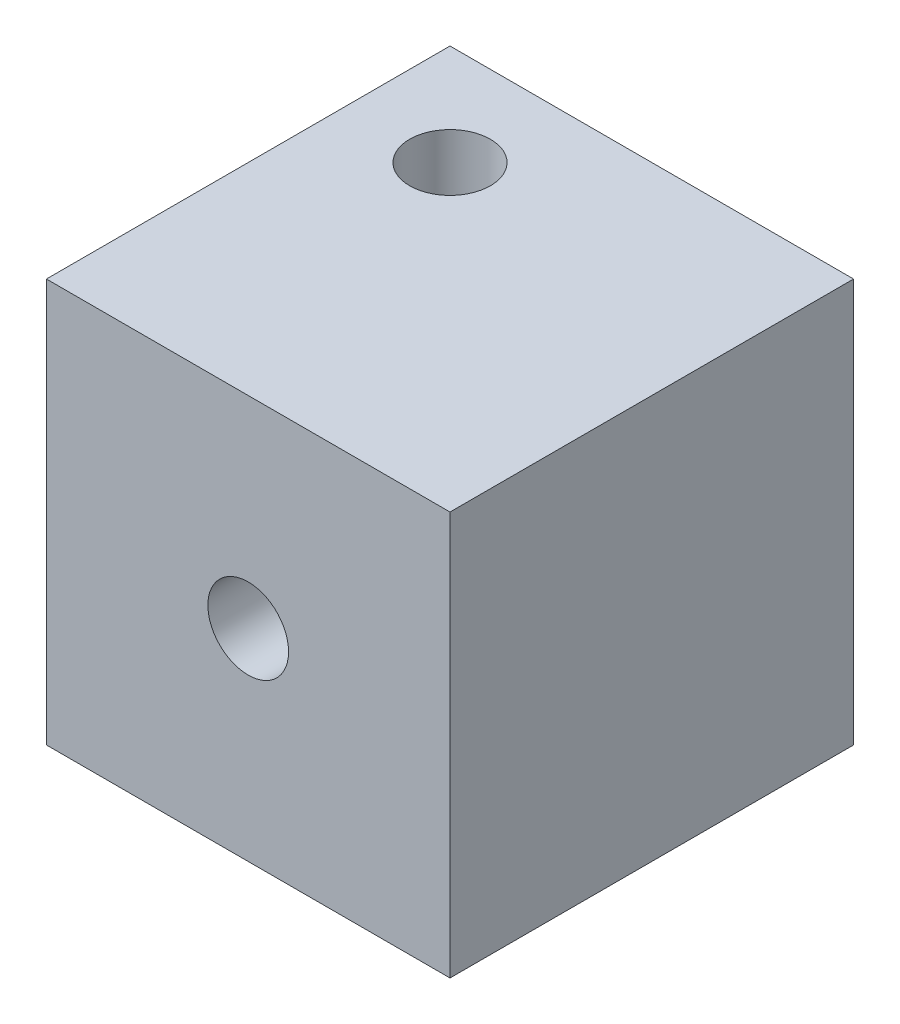
ISO-10303-21;
HEADER;
FILE_DESCRIPTION(('STEP AP214'),'2;1');
FILE_NAME('part.step','',(''),(''),'','','');
FILE_SCHEMA(('AUTOMOTIVE_DESIGN { 1 0 10303 214 1 1 1 1 }'));
ENDSEC;
DATA;
#1=APPLICATION_CONTEXT('core data for automotive mechanical design processes');
#2=APPLICATION_PROTOCOL_DEFINITION('international standard','automotive_design',2000,#1);
#3=PRODUCT_CONTEXT('',#1,'mechanical');
#4=PRODUCT('Part','Part','',(#3));
#5=PRODUCT_RELATED_PRODUCT_CATEGORY('part','',(#4));
#6=PRODUCT_DEFINITION_FORMATION('','',#4);
#7=PRODUCT_DEFINITION_CONTEXT('part definition',#1,'design');
#8=PRODUCT_DEFINITION('design','',#6,#7);
#9=PRODUCT_DEFINITION_SHAPE('','',#8);
#10=(LENGTH_UNIT() NAMED_UNIT(*) SI_UNIT(.MILLI.,.METRE.));
#11=(NAMED_UNIT(*) PLANE_ANGLE_UNIT() SI_UNIT($,.RADIAN.));
#12=(NAMED_UNIT(*) SI_UNIT($,.STERADIAN.) SOLID_ANGLE_UNIT());
#13=UNCERTAINTY_MEASURE_WITH_UNIT(LENGTH_MEASURE(1.E-05),#10,'distance_accuracy_value','');
#14=(GEOMETRIC_REPRESENTATION_CONTEXT(3) GLOBAL_UNCERTAINTY_ASSIGNED_CONTEXT((#13)) GLOBAL_UNIT_ASSIGNED_CONTEXT((#10,
#11,#12)) REPRESENTATION_CONTEXT('',''));
#15=CARTESIAN_POINT('',(0.,0.,0.));
#16=DIRECTION('',(0.,0.,1.));
#17=DIRECTION('',(1.,0.,0.));
#18=AXIS2_PLACEMENT_3D('',#15,#16,#17);
#19=CARTESIAN_POINT('',(-100.,100.,100.));
#20=DIRECTION('',(1.,0.,0.));
#21=DIRECTION('',(0.,0.,-1.));
#22=AXIS2_PLACEMENT_3D('',#19,#20,#21);
#23=PLANE('',#22);
#24=DIRECTION('',(0.,-1.,0.));
#25=VECTOR('',#24,1.);
#26=CARTESIAN_POINT('',(-100.,100.,0.));
#27=LINE('',#26,#25);
#28=CARTESIAN_POINT('',(-100.,100.,0.));
#29=VERTEX_POINT('',#28);
#30=CARTESIAN_POINT('',(-100.,0.,0.));
#31=VERTEX_POINT('',#30);
#32=EDGE_CURVE('E96',#29,#31,#27,.T.);
#33=ORIENTED_EDGE('',*,*,#32,.T.);
#34=DIRECTION('',(0.,0.,-1.));
#35=VECTOR('',#34,1.);
#36=CARTESIAN_POINT('',(-100.,0.,100.));
#37=LINE('',#36,#35);
#38=CARTESIAN_POINT('',(-100.,0.,100.));
#39=VERTEX_POINT('',#38);
#40=EDGE_CURVE('E11',#39,#31,#37,.T.);
#41=ORIENTED_EDGE('',*,*,#40,.F.);
#42=DIRECTION('',(0.,-1.,0.));
#43=VECTOR('',#42,1.);
#44=CARTESIAN_POINT('',(-100.,100.,100.));
#45=LINE('',#44,#43);
#46=CARTESIAN_POINT('',(-100.,100.,100.));
#47=VERTEX_POINT('',#46);
#48=EDGE_CURVE('E84',#47,#39,#45,.T.);
#49=ORIENTED_EDGE('',*,*,#48,.F.);
#50=DIRECTION('',(0.,0.,-1.));
#51=VECTOR('',#50,1.);
#52=CARTESIAN_POINT('',(-100.,100.,100.));
#53=LINE('',#52,#51);
#54=EDGE_CURVE('E92',#47,#29,#53,.T.);
#55=ORIENTED_EDGE('',*,*,#54,.T.);
#56=EDGE_LOOP('',(#33,#41,#49,#55));
#57=FACE_BOUND('',#56,.T.);
#58=ADVANCED_FACE('F33',(#57),#23,.F.);
#59=CARTESIAN_POINT('',(-100.,0.,100.));
#60=DIRECTION('',(0.,1.,0.));
#61=DIRECTION('',(0.,0.,1.));
#62=AXIS2_PLACEMENT_3D('',#59,#60,#61);
#63=PLANE('',#62);
#64=CARTESIAN_POINT('',(-75.,0.,25.));
#65=DIRECTION('',(0.,1.,0.));
#66=DIRECTION('',(0.,0.,1.));
#67=AXIS2_PLACEMENT_3D('',#64,#65,#66);
#68=CIRCLE('',#67,10.);
#69=CARTESIAN_POINT('',(-75.,0.,35.));
#70=VERTEX_POINT('',#69);
#71=EDGE_CURVE('E113',#70,#70,#68,.T.);
#72=ORIENTED_EDGE('',*,*,#71,.T.);
#73=EDGE_LOOP('',(#72));
#74=FACE_BOUND('',#73,.T.);
#75=DIRECTION('',(1.,0.,0.));
#76=VECTOR('',#75,1.);
#77=CARTESIAN_POINT('',(-100.,0.,0.));
#78=LINE('',#77,#76);
#79=CARTESIAN_POINT('',(0.,0.,0.));
#80=VERTEX_POINT('',#79);
#81=EDGE_CURVE('E88',#31,#80,#78,.T.);
#82=ORIENTED_EDGE('',*,*,#81,.T.);
#83=DIRECTION('',(0.,0.,-1.));
#84=VECTOR('',#83,1.);
#85=CARTESIAN_POINT('',(0.,0.,100.));
#86=LINE('',#85,#84);
#87=CARTESIAN_POINT('',(0.,0.,100.));
#88=VERTEX_POINT('',#87);
#89=EDGE_CURVE('E41',#88,#80,#86,.T.);
#90=ORIENTED_EDGE('',*,*,#89,.F.);
#91=DIRECTION('',(1.,0.,0.));
#92=VECTOR('',#91,1.);
#93=CARTESIAN_POINT('',(-100.,0.,100.));
#94=LINE('',#93,#92);
#95=EDGE_CURVE('E79',#39,#88,#94,.T.);
#96=ORIENTED_EDGE('',*,*,#95,.F.);
#97=ORIENTED_EDGE('',*,*,#40,.T.);
#98=EDGE_LOOP('',(#82,#90,#96,#97));
#99=FACE_BOUND('',#98,.T.);
#100=ADVANCED_FACE('F87',(#74,#99),#63,.F.);
#101=CARTESIAN_POINT('',(0.,100.,100.));
#102=DIRECTION('',(-1.,0.,0.));
#103=DIRECTION('',(0.,-1.,0.));
#104=AXIS2_PLACEMENT_3D('',#101,#102,#103);
#105=PLANE('',#104);
#106=DIRECTION('',(0.,1.,0.));
#107=VECTOR('',#106,1.);
#108=CARTESIAN_POINT('',(0.,100.,0.));
#109=LINE('',#108,#107);
#110=CARTESIAN_POINT('',(0.,100.,0.));
#111=VERTEX_POINT('',#110);
#112=EDGE_CURVE('E66',#80,#111,#109,.T.);
#113=ORIENTED_EDGE('',*,*,#112,.T.);
#114=DIRECTION('',(0.,0.,-1.));
#115=VECTOR('',#114,1.);
#116=CARTESIAN_POINT('',(0.,100.,100.));
#117=LINE('',#116,#115);
#118=CARTESIAN_POINT('',(0.,100.,100.));
#119=VERTEX_POINT('',#118);
#120=EDGE_CURVE('E89',#119,#111,#117,.T.);
#121=ORIENTED_EDGE('',*,*,#120,.F.);
#122=DIRECTION('',(0.,1.,0.));
#123=VECTOR('',#122,1.);
#124=CARTESIAN_POINT('',(0.,100.,100.));
#125=LINE('',#124,#123);
#126=EDGE_CURVE('E82',#88,#119,#125,.T.);
#127=ORIENTED_EDGE('',*,*,#126,.F.);
#128=ORIENTED_EDGE('',*,*,#89,.T.);
#129=EDGE_LOOP('',(#113,#121,#127,#128));
#130=FACE_BOUND('',#129,.T.);
#131=ADVANCED_FACE('F90',(#130),#105,.F.);
#132=CARTESIAN_POINT('',(-100.,100.,100.));
#133=DIRECTION('',(0.,-1.,0.));
#134=DIRECTION('',(0.,0.,-1.));
#135=AXIS2_PLACEMENT_3D('',#132,#133,#134);
#136=PLANE('',#135);
#137=CARTESIAN_POINT('',(-75.,100.,25.));
#138=DIRECTION('',(0.,1.,0.));
#139=DIRECTION('',(0.,0.,1.));
#140=AXIS2_PLACEMENT_3D('',#137,#138,#139);
#141=CIRCLE('',#140,10.);
#142=CARTESIAN_POINT('',(-75.,100.,35.));
#143=VERTEX_POINT('',#142);
#144=EDGE_CURVE('E116',#143,#143,#141,.T.);
#145=ORIENTED_EDGE('',*,*,#144,.F.);
#146=EDGE_LOOP('',(#145));
#147=FACE_BOUND('',#146,.T.);
#148=DIRECTION('',(-1.,0.,0.));
#149=VECTOR('',#148,1.);
#150=CARTESIAN_POINT('',(-100.,100.,0.));
#151=LINE('',#150,#149);
#152=EDGE_CURVE('E72',#111,#29,#151,.T.);
#153=ORIENTED_EDGE('',*,*,#152,.T.);
#154=ORIENTED_EDGE('',*,*,#54,.F.);
#155=DIRECTION('',(-1.,0.,0.));
#156=VECTOR('',#155,1.);
#157=CARTESIAN_POINT('',(-100.,100.,100.));
#158=LINE('',#157,#156);
#159=EDGE_CURVE('E49',#119,#47,#158,.T.);
#160=ORIENTED_EDGE('',*,*,#159,.F.);
#161=ORIENTED_EDGE('',*,*,#120,.T.);
#162=EDGE_LOOP('',(#153,#154,#160,#161));
#163=FACE_BOUND('',#162,.T.);
#164=ADVANCED_FACE('F104',(#147,#163),#136,.F.);
#165=CARTESIAN_POINT('',(0.,0.,100.));
#166=DIRECTION('',(0.,0.,1.));
#167=DIRECTION('',(1.,0.,0.));
#168=AXIS2_PLACEMENT_3D('',#165,#166,#167);
#169=PLANE('',#168);
#170=CARTESIAN_POINT('',(-50.,50.,100.));
#171=DIRECTION('',(0.,0.,1.));
#172=DIRECTION('',(1.,0.,0.));
#173=AXIS2_PLACEMENT_3D('',#170,#171,#172);
#174=CIRCLE('',#173,10.);
#175=CARTESIAN_POINT('',(-40.,50.,100.));
#176=VERTEX_POINT('',#175);
#177=EDGE_CURVE('E110',#176,#176,#174,.T.);
#178=ORIENTED_EDGE('',*,*,#177,.F.);
#179=EDGE_LOOP('',(#178));
#180=FACE_BOUND('',#179,.T.);
#181=ORIENTED_EDGE('',*,*,#48,.T.);
#182=ORIENTED_EDGE('',*,*,#95,.T.);
#183=ORIENTED_EDGE('',*,*,#126,.T.);
#184=ORIENTED_EDGE('',*,*,#159,.T.);
#185=EDGE_LOOP('',(#181,#182,#183,#184));
#186=FACE_BOUND('',#185,.T.);
#187=ADVANCED_FACE('F80',(#180,#186),#169,.T.);
#188=CARTESIAN_POINT('',(0.,0.,0.));
#189=DIRECTION('',(0.,0.,1.));
#190=DIRECTION('',(1.,0.,0.));
#191=AXIS2_PLACEMENT_3D('',#188,#189,#190);
#192=PLANE('',#191);
#193=CARTESIAN_POINT('',(-50.,50.,0.));
#194=DIRECTION('',(0.,0.,1.));
#195=DIRECTION('',(1.,0.,0.));
#196=AXIS2_PLACEMENT_3D('',#193,#194,#195);
#197=CIRCLE('',#196,10.);
#198=CARTESIAN_POINT('',(-40.,50.,0.));
#199=VERTEX_POINT('',#198);
#200=EDGE_CURVE('E99',#199,#199,#197,.T.);
#201=ORIENTED_EDGE('',*,*,#200,.T.);
#202=EDGE_LOOP('',(#201));
#203=FACE_BOUND('',#202,.T.);
#204=ORIENTED_EDGE('',*,*,#32,.F.);
#205=ORIENTED_EDGE('',*,*,#152,.F.);
#206=ORIENTED_EDGE('',*,*,#112,.F.);
#207=ORIENTED_EDGE('',*,*,#81,.F.);
#208=EDGE_LOOP('',(#204,#205,#206,#207));
#209=FACE_BOUND('',#208,.T.);
#210=ADVANCED_FACE('F107',(#203,#209),#192,.F.);
#211=CARTESIAN_POINT('',(-50.,50.,0.));
#212=DIRECTION('',(0.,0.,1.));
#213=DIRECTION('',(1.,0.,0.));
#214=AXIS2_PLACEMENT_3D('',#211,#212,#213);
#215=CYLINDRICAL_SURFACE('',#214,10.);
#216=ORIENTED_EDGE('',*,*,#200,.F.);
#217=EDGE_LOOP('',(#216));
#218=FACE_BOUND('',#217,.T.);
#219=ORIENTED_EDGE('',*,*,#177,.T.);
#220=EDGE_LOOP('',(#219));
#221=FACE_BOUND('',#220,.T.);
#222=ADVANCED_FACE('F126',(#218,#221),#215,.F.);
#223=CARTESIAN_POINT('',(-75.,0.,25.));
#224=DIRECTION('',(0.,1.,0.));
#225=DIRECTION('',(0.,0.,1.));
#226=AXIS2_PLACEMENT_3D('',#223,#224,#225);
#227=CYLINDRICAL_SURFACE('',#226,10.);
#228=ORIENTED_EDGE('',*,*,#71,.F.);
#229=EDGE_LOOP('',(#228));
#230=FACE_BOUND('',#229,.T.);
#231=ORIENTED_EDGE('',*,*,#144,.T.);
#232=EDGE_LOOP('',(#231));
#233=FACE_BOUND('',#232,.T.);
#234=ADVANCED_FACE('F123',(#230,#233),#227,.F.);
#235=CLOSED_SHELL('',(#58,#100,#131,#164,#187,#210,#222,#234));
#236=MANIFOLD_SOLID_BREP('B2',#235);
#237=ADVANCED_BREP_SHAPE_REPRESENTATION('',(#18,#236),#14);
#238=SHAPE_DEFINITION_REPRESENTATION(#9,#237);
ENDSEC;
END-ISO-10303-21;
